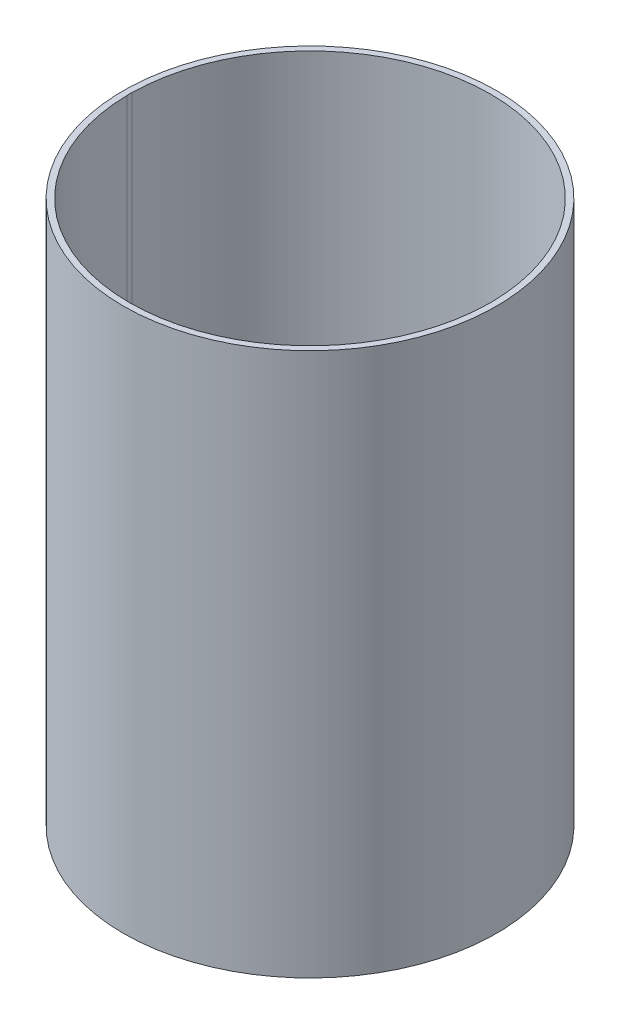
ISO-10303-21;
HEADER;
FILE_DESCRIPTION(('STEP AP214'),'2;1');
FILE_NAME('part.step','',(''),(''),'','','');
FILE_SCHEMA(('AUTOMOTIVE_DESIGN { 1 0 10303 214 1 1 1 1 }'));
ENDSEC;
DATA;
#1=APPLICATION_CONTEXT('core data for automotive mechanical design processes');
#2=APPLICATION_PROTOCOL_DEFINITION('international standard','automotive_design',2000,#1);
#3=PRODUCT_CONTEXT('',#1,'mechanical');
#4=PRODUCT('Part','Part','',(#3));
#5=PRODUCT_RELATED_PRODUCT_CATEGORY('part','',(#4));
#6=PRODUCT_DEFINITION_FORMATION('','',#4);
#7=PRODUCT_DEFINITION_CONTEXT('part definition',#1,'design');
#8=PRODUCT_DEFINITION('design','',#6,#7);
#9=PRODUCT_DEFINITION_SHAPE('','',#8);
#10=(LENGTH_UNIT() NAMED_UNIT(*) SI_UNIT(.MILLI.,.METRE.));
#11=(NAMED_UNIT(*) PLANE_ANGLE_UNIT() SI_UNIT($,.RADIAN.));
#12=(NAMED_UNIT(*) SI_UNIT($,.STERADIAN.) SOLID_ANGLE_UNIT());
#13=UNCERTAINTY_MEASURE_WITH_UNIT(LENGTH_MEASURE(1.E-05),#10,'distance_accuracy_value','');
#14=(GEOMETRIC_REPRESENTATION_CONTEXT(3) GLOBAL_UNCERTAINTY_ASSIGNED_CONTEXT((#13)) GLOBAL_UNIT_ASSIGNED_CONTEXT((#10,
#11,#12)) REPRESENTATION_CONTEXT('',''));
#15=CARTESIAN_POINT('',(0.,0.,0.));
#16=DIRECTION('',(0.,0.,1.));
#17=DIRECTION('',(1.,0.,0.));
#18=AXIS2_PLACEMENT_3D('',#15,#16,#17);
#19=CARTESIAN_POINT('',(0.,269.875,0.));
#20=DIRECTION('',(0.,-1.,0.));
#21=DIRECTION('',(0.,0.,-1.));
#22=AXIS2_PLACEMENT_3D('',#19,#20,#21);
#23=CYLINDRICAL_SURFACE('',#22,89.71);
#24=DIRECTION('',(0.,-1.,0.));
#25=VECTOR('',#24,1.);
#26=CARTESIAN_POINT('',(-89.7006638779526,134.9375,-1.29421785436021));
#27=LINE('',#26,#25);
#28=CARTESIAN_POINT('',(-89.7006638779527,3.17499999999998,-1.29421785436023));
#29=VERTEX_POINT('',#28);
#30=CARTESIAN_POINT('',(-89.7006638779527,269.875,-1.29421785435928));
#31=VERTEX_POINT('',#30);
#32=EDGE_CURVE('E11',#29,#31,#27,.F.);
#33=ORIENTED_EDGE('',*,*,#32,.F.);
#34=CARTESIAN_POINT('',(0.,3.17499999999998,0.));
#35=DIRECTION('',(0.,1.,0.));
#36=DIRECTION('',(0.,0.,1.));
#37=AXIS2_PLACEMENT_3D('',#34,#35,#36);
#38=CIRCLE('',#37,89.71);
#39=CARTESIAN_POINT('',(89.7006638779527,3.17499999999998,-1.29421785436022));
#40=VERTEX_POINT('',#39);
#41=EDGE_CURVE('E112',#29,#40,#38,.F.);
#42=ORIENTED_EDGE('',*,*,#41,.T.);
#43=DIRECTION('',(0.,-1.,0.));
#44=VECTOR('',#43,1.);
#45=CARTESIAN_POINT('',(89.7006638779526,134.9375,-1.29421785436021));
#46=LINE('',#45,#44);
#47=CARTESIAN_POINT('',(89.7006638779527,269.875,-1.29421785435928));
#48=VERTEX_POINT('',#47);
#49=EDGE_CURVE('E79',#48,#40,#46,.T.);
#50=ORIENTED_EDGE('',*,*,#49,.F.);
#51=CARTESIAN_POINT('',(0.,269.875,0.));
#52=DIRECTION('',(0.,1.,0.));
#53=DIRECTION('',(0.,0.,1.));
#54=AXIS2_PLACEMENT_3D('',#51,#52,#53);
#55=CIRCLE('',#54,89.71);
#56=EDGE_CURVE('E88',#48,#31,#55,.T.);
#57=ORIENTED_EDGE('',*,*,#56,.T.);
#58=EDGE_LOOP('',(#33,#42,#50,#57));
#59=FACE_BOUND('',#58,.T.);
#60=ADVANCED_FACE('F32',(#59),#23,.F.);
#61=CARTESIAN_POINT('',(0.,3.175,0.));
#62=DIRECTION('',(0.,1.,0.));
#63=DIRECTION('',(0.,0.,1.));
#64=AXIS2_PLACEMENT_3D('',#61,#62,#63);
#65=PLANE('',#64);
#66=CARTESIAN_POINT('',(-80.264,3.17499999999998,0.));
#67=DIRECTION('',(0.,1.,0.));
#68=DIRECTION('',(0.,0.,1.));
#69=AXIS2_PLACEMENT_3D('',#66,#67,#68);
#70=CIRCLE('',#69,9.52500000000001);
#71=CARTESIAN_POINT('',(-89.7006638779527,3.17499999999998,1.29421785436019));
#72=VERTEX_POINT('',#71);
#73=EDGE_CURVE('E93',#72,#29,#70,.T.);
#74=ORIENTED_EDGE('',*,*,#73,.F.);
#75=CARTESIAN_POINT('',(89.7006638779527,3.17499999999998,1.29421785436021));
#76=VERTEX_POINT('',#75);
#77=EDGE_CURVE('E110',#76,#72,#38,.F.);
#78=ORIENTED_EDGE('',*,*,#77,.F.);
#79=CARTESIAN_POINT('',(80.264,3.17499999999998,0.));
#80=DIRECTION('',(0.,1.,0.));
#81=DIRECTION('',(0.,0.,1.));
#82=AXIS2_PLACEMENT_3D('',#79,#80,#81);
#83=CIRCLE('',#82,9.52500000000001);
#84=EDGE_CURVE('E74',#40,#76,#83,.T.);
#85=ORIENTED_EDGE('',*,*,#84,.F.);
#86=ORIENTED_EDGE('',*,*,#41,.F.);
#87=EDGE_LOOP('',(#74,#78,#85,#86));
#88=FACE_BOUND('',#87,.T.);
#89=CARTESIAN_POINT('',(0.,3.175,0.));
#90=DIRECTION('',(0.,1.,0.));
#91=DIRECTION('',(0.,0.,1.));
#92=AXIS2_PLACEMENT_3D('',#89,#90,#91);
#93=CIRCLE('',#92,53.975);
#94=CARTESIAN_POINT('',(0.,3.175,53.975));
#95=VERTEX_POINT('',#94);
#96=EDGE_CURVE('E102',#95,#95,#93,.T.);
#97=ORIENTED_EDGE('',*,*,#96,.F.);
#98=EDGE_LOOP('',(#97));
#99=FACE_BOUND('',#98,.T.);
#100=ADVANCED_FACE('F119',(#88,#99),#65,.T.);
#101=CARTESIAN_POINT('',(0.,0.,0.));
#102=DIRECTION('',(0.,1.,0.));
#103=DIRECTION('',(0.,0.,1.));
#104=AXIS2_PLACEMENT_3D('',#101,#102,#103);
#105=PLANE('',#104);
#106=CARTESIAN_POINT('',(-80.264,0.,0.));
#107=DIRECTION('',(0.,-1.,0.));
#108=DIRECTION('',(0.,0.,-1.));
#109=AXIS2_PLACEMENT_3D('',#106,#107,#108);
#110=CIRCLE('',#109,9.52500000000001);
#111=CARTESIAN_POINT('',(-80.264,0.,-9.52500000000002));
#112=VERTEX_POINT('',#111);
#113=EDGE_CURVE('E89',#112,#112,#110,.T.);
#114=ORIENTED_EDGE('',*,*,#113,.F.);
#115=EDGE_LOOP('',(#114));
#116=FACE_BOUND('',#115,.T.);
#117=CARTESIAN_POINT('',(80.264,0.,0.));
#118=DIRECTION('',(0.,-1.,0.));
#119=DIRECTION('',(0.,0.,1.));
#120=AXIS2_PLACEMENT_3D('',#117,#118,#119);
#121=CIRCLE('',#120,9.52500000000001);
#122=CARTESIAN_POINT('',(80.264,0.,9.525));
#123=VERTEX_POINT('',#122);
#124=EDGE_CURVE('E90',#123,#123,#121,.T.);
#125=ORIENTED_EDGE('',*,*,#124,.F.);
#126=EDGE_LOOP('',(#125));
#127=FACE_BOUND('',#126,.T.);
#128=CARTESIAN_POINT('',(0.,0.,0.));
#129=DIRECTION('',(0.,1.,0.));
#130=DIRECTION('',(0.,0.,1.));
#131=AXIS2_PLACEMENT_3D('',#128,#129,#130);
#132=CIRCLE('',#131,92.71);
#133=CARTESIAN_POINT('',(0.,0.,92.71));
#134=VERTEX_POINT('',#133);
#135=EDGE_CURVE('E105',#134,#134,#132,.T.);
#136=ORIENTED_EDGE('',*,*,#135,.F.);
#137=EDGE_LOOP('',(#136));
#138=FACE_BOUND('',#137,.T.);
#139=CARTESIAN_POINT('',(0.,0.,0.));
#140=DIRECTION('',(0.,1.,0.));
#141=DIRECTION('',(0.,0.,1.));
#142=AXIS2_PLACEMENT_3D('',#139,#140,#141);
#143=CIRCLE('',#142,53.975);
#144=CARTESIAN_POINT('',(0.,0.,53.975));
#145=VERTEX_POINT('',#144);
#146=EDGE_CURVE('E101',#145,#145,#143,.T.);
#147=ORIENTED_EDGE('',*,*,#146,.T.);
#148=EDGE_LOOP('',(#147));
#149=FACE_BOUND('',#148,.T.);
#150=ADVANCED_FACE('F130',(#116,#127,#138,#149),#105,.F.);
#151=CARTESIAN_POINT('',(0.,3.175,0.));
#152=DIRECTION('',(0.,-1.,0.));
#153=DIRECTION('',(0.,0.,-1.));
#154=AXIS2_PLACEMENT_3D('',#151,#152,#153);
#155=CYLINDRICAL_SURFACE('',#154,92.71);
#156=ORIENTED_EDGE('',*,*,#135,.T.);
#157=EDGE_LOOP('',(#156));
#158=FACE_BOUND('',#157,.T.);
#159=CARTESIAN_POINT('',(0.,269.875,0.));
#160=DIRECTION('',(0.,1.,0.));
#161=DIRECTION('',(0.,0.,1.));
#162=AXIS2_PLACEMENT_3D('',#159,#160,#161);
#163=CIRCLE('',#162,92.71);
#164=CARTESIAN_POINT('',(0.,269.875,92.71));
#165=VERTEX_POINT('',#164);
#166=EDGE_CURVE('E95',#165,#165,#163,.T.);
#167=ORIENTED_EDGE('',*,*,#166,.F.);
#168=EDGE_LOOP('',(#167));
#169=FACE_BOUND('',#168,.T.);
#170=ADVANCED_FACE('F34',(#158,#169),#155,.T.);
#171=CARTESIAN_POINT('',(0.,3.175,0.));
#172=DIRECTION('',(0.,-1.,0.));
#173=DIRECTION('',(0.,0.,-1.));
#174=AXIS2_PLACEMENT_3D('',#171,#172,#173);
#175=CYLINDRICAL_SURFACE('',#174,53.975);
#176=ORIENTED_EDGE('',*,*,#96,.T.);
#177=EDGE_LOOP('',(#176));
#178=FACE_BOUND('',#177,.T.);
#179=ORIENTED_EDGE('',*,*,#146,.F.);
#180=EDGE_LOOP('',(#179));
#181=FACE_BOUND('',#180,.T.);
#182=ADVANCED_FACE('F138',(#178,#181),#175,.F.);
#183=CARTESIAN_POINT('',(0.,269.875,0.));
#184=DIRECTION('',(0.,1.,0.));
#185=DIRECTION('',(0.,0.,1.));
#186=AXIS2_PLACEMENT_3D('',#183,#184,#185);
#187=PLANE('',#186);
#188=CARTESIAN_POINT('',(-80.264,269.875,0.));
#189=DIRECTION('',(0.,-1.,0.));
#190=DIRECTION('',(0.,0.,-1.));
#191=AXIS2_PLACEMENT_3D('',#188,#189,#190);
#192=CIRCLE('',#191,9.52500000000001);
#193=CARTESIAN_POINT('',(-89.7006638779527,269.875,1.29421785435925));
#194=VERTEX_POINT('',#193);
#195=EDGE_CURVE('E46',#194,#31,#192,.T.);
#196=ORIENTED_EDGE('',*,*,#195,.T.);
#197=ORIENTED_EDGE('',*,*,#56,.F.);
#198=CARTESIAN_POINT('',(80.264,269.875,0.));
#199=DIRECTION('',(0.,-1.,0.));
#200=DIRECTION('',(0.,0.,1.));
#201=AXIS2_PLACEMENT_3D('',#198,#199,#200);
#202=CIRCLE('',#201,9.52500000000001);
#203=CARTESIAN_POINT('',(89.7006638779527,269.875,1.29421785435925));
#204=VERTEX_POINT('',#203);
#205=EDGE_CURVE('E54',#48,#204,#202,.T.);
#206=ORIENTED_EDGE('',*,*,#205,.T.);
#207=EDGE_CURVE('E86',#194,#204,#55,.T.);
#208=ORIENTED_EDGE('',*,*,#207,.F.);
#209=EDGE_LOOP('',(#196,#197,#206,#208));
#210=FACE_BOUND('',#209,.T.);
#211=ORIENTED_EDGE('',*,*,#166,.T.);
#212=EDGE_LOOP('',(#211));
#213=FACE_BOUND('',#212,.T.);
#214=ADVANCED_FACE('F84',(#210,#213),#187,.T.);
#215=DIRECTION('',(0.,-1.,0.));
#216=VECTOR('',#215,1.);
#217=CARTESIAN_POINT('',(-89.7006638779526,134.9375,1.29421785436019));
#218=LINE('',#217,#216);
#219=EDGE_CURVE('E40',#194,#72,#218,.T.);
#220=ORIENTED_EDGE('',*,*,#219,.F.);
#221=ORIENTED_EDGE('',*,*,#207,.T.);
#222=DIRECTION('',(0.,-1.,0.));
#223=VECTOR('',#222,1.);
#224=CARTESIAN_POINT('',(89.7006638779526,134.9375,1.29421785436019));
#225=LINE('',#224,#223);
#226=EDGE_CURVE('E70',#76,#204,#225,.F.);
#227=ORIENTED_EDGE('',*,*,#226,.F.);
#228=ORIENTED_EDGE('',*,*,#77,.T.);
#229=EDGE_LOOP('',(#220,#221,#227,#228));
#230=FACE_BOUND('',#229,.T.);
#231=ADVANCED_FACE('F92',(#230),#23,.F.);
#232=CARTESIAN_POINT('',(80.264,269.875,0.));
#233=DIRECTION('',(0.,-1.,0.));
#234=DIRECTION('',(0.,0.,-1.));
#235=AXIS2_PLACEMENT_3D('',#232,#233,#234);
#236=CYLINDRICAL_SURFACE('',#235,9.52500000000001);
#237=ORIENTED_EDGE('',*,*,#226,.T.);
#238=ORIENTED_EDGE('',*,*,#205,.F.);
#239=ORIENTED_EDGE('',*,*,#49,.T.);
#240=ORIENTED_EDGE('',*,*,#84,.T.);
#241=EDGE_LOOP('',(#237,#238,#239,#240));
#242=FACE_BOUND('',#241,.T.);
#243=ORIENTED_EDGE('',*,*,#124,.T.);
#244=EDGE_LOOP('',(#243));
#245=FACE_BOUND('',#244,.T.);
#246=ADVANCED_FACE('F71',(#242,#245),#236,.F.);
#247=CARTESIAN_POINT('',(-80.264,269.875,0.));
#248=DIRECTION('',(0.,-1.,0.));
#249=DIRECTION('',(0.,0.,-1.));
#250=AXIS2_PLACEMENT_3D('',#247,#248,#249);
#251=CYLINDRICAL_SURFACE('',#250,9.52500000000001);
#252=ORIENTED_EDGE('',*,*,#32,.T.);
#253=ORIENTED_EDGE('',*,*,#195,.F.);
#254=ORIENTED_EDGE('',*,*,#219,.T.);
#255=ORIENTED_EDGE('',*,*,#73,.T.);
#256=EDGE_LOOP('',(#252,#253,#254,#255));
#257=FACE_BOUND('',#256,.T.);
#258=ORIENTED_EDGE('',*,*,#113,.T.);
#259=EDGE_LOOP('',(#258));
#260=FACE_BOUND('',#259,.T.);
#261=ADVANCED_FACE('F114',(#257,#260),#251,.F.);
#262=CLOSED_SHELL('',(#60,#100,#150,#170,#182,#214,#231,#246,#261));
#263=MANIFOLD_SOLID_BREP('B2',#262);
#264=ADVANCED_BREP_SHAPE_REPRESENTATION('',(#18,#263),#14);
#265=SHAPE_DEFINITION_REPRESENTATION(#9,#264);
ENDSEC;
END-ISO-10303-21;
